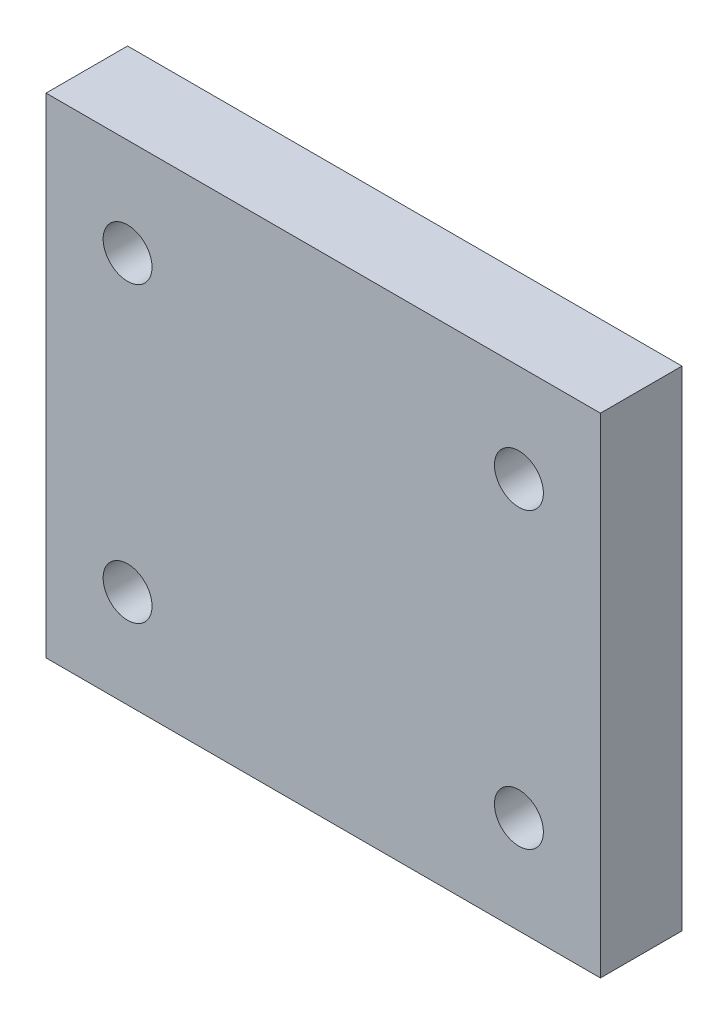
ISO-10303-21;
HEADER;
FILE_DESCRIPTION(('STEP AP214'),'2;1');
FILE_NAME('part.step','',(''),(''),'','','');
FILE_SCHEMA(('AUTOMOTIVE_DESIGN { 1 0 10303 214 1 1 1 1 }'));
ENDSEC;
DATA;
#1=APPLICATION_CONTEXT('core data for automotive mechanical design processes');
#2=APPLICATION_PROTOCOL_DEFINITION('international standard','automotive_design',2000,#1);
#3=PRODUCT_CONTEXT('',#1,'mechanical');
#4=PRODUCT('Part','Part','',(#3));
#5=PRODUCT_RELATED_PRODUCT_CATEGORY('part','',(#4));
#6=PRODUCT_DEFINITION_FORMATION('','',#4);
#7=PRODUCT_DEFINITION_CONTEXT('part definition',#1,'design');
#8=PRODUCT_DEFINITION('design','',#6,#7);
#9=PRODUCT_DEFINITION_SHAPE('','',#8);
#10=(LENGTH_UNIT() NAMED_UNIT(*) SI_UNIT(.MILLI.,.METRE.));
#11=(NAMED_UNIT(*) PLANE_ANGLE_UNIT() SI_UNIT($,.RADIAN.));
#12=(NAMED_UNIT(*) SI_UNIT($,.STERADIAN.) SOLID_ANGLE_UNIT());
#13=UNCERTAINTY_MEASURE_WITH_UNIT(LENGTH_MEASURE(1.E-05),#10,'distance_accuracy_value','');
#14=(GEOMETRIC_REPRESENTATION_CONTEXT(3) GLOBAL_UNCERTAINTY_ASSIGNED_CONTEXT((#13)) GLOBAL_UNIT_ASSIGNED_CONTEXT((#10,
#11,#12)) REPRESENTATION_CONTEXT('',''));
#15=CARTESIAN_POINT('',(0.,0.,0.));
#16=DIRECTION('',(0.,0.,1.));
#17=DIRECTION('',(1.,0.,0.));
#18=AXIS2_PLACEMENT_3D('',#15,#16,#17);
#19=CARTESIAN_POINT('',(-17.0000000000004,-14.9999999999998,5.));
#20=DIRECTION('',(1.,0.,0.));
#21=DIRECTION('',(0.,0.,-1.));
#22=AXIS2_PLACEMENT_3D('',#19,#20,#21);
#23=PLANE('',#22);
#24=DIRECTION('',(0.,-1.,0.));
#25=VECTOR('',#24,1.);
#26=CARTESIAN_POINT('',(-17.0000000000004,-14.9999999999998,0.));
#27=LINE('',#26,#25);
#28=CARTESIAN_POINT('',(-17.0000000000004,14.9999999999998,0.));
#29=VERTEX_POINT('',#28);
#30=CARTESIAN_POINT('',(-17.0000000000004,-14.9999999999998,0.));
#31=VERTEX_POINT('',#30);
#32=EDGE_CURVE('E96',#29,#31,#27,.T.);
#33=ORIENTED_EDGE('',*,*,#32,.T.);
#34=DIRECTION('',(0.,0.,-1.));
#35=VECTOR('',#34,1.);
#36=CARTESIAN_POINT('',(-17.0000000000004,-14.9999999999998,5.));
#37=LINE('',#36,#35);
#38=CARTESIAN_POINT('',(-17.0000000000004,-14.9999999999998,5.));
#39=VERTEX_POINT('',#38);
#40=EDGE_CURVE('E11',#39,#31,#37,.T.);
#41=ORIENTED_EDGE('',*,*,#40,.F.);
#42=DIRECTION('',(0.,-1.,0.));
#43=VECTOR('',#42,1.);
#44=CARTESIAN_POINT('',(-17.0000000000004,-14.9999999999998,5.));
#45=LINE('',#44,#43);
#46=CARTESIAN_POINT('',(-17.0000000000004,14.9999999999998,5.));
#47=VERTEX_POINT('',#46);
#48=EDGE_CURVE('E84',#47,#39,#45,.T.);
#49=ORIENTED_EDGE('',*,*,#48,.F.);
#50=DIRECTION('',(0.,0.,-1.));
#51=VECTOR('',#50,1.);
#52=CARTESIAN_POINT('',(-17.0000000000004,14.9999999999998,5.));
#53=LINE('',#52,#51);
#54=EDGE_CURVE('E92',#47,#29,#53,.T.);
#55=ORIENTED_EDGE('',*,*,#54,.T.);
#56=EDGE_LOOP('',(#33,#41,#49,#55));
#57=FACE_BOUND('',#56,.T.);
#58=ADVANCED_FACE('F33',(#57),#23,.F.);
#59=CARTESIAN_POINT('',(17.0000000000004,-14.9999999999998,5.));
#60=DIRECTION('',(0.,1.,0.));
#61=DIRECTION('',(0.,0.,1.));
#62=AXIS2_PLACEMENT_3D('',#59,#60,#61);
#63=PLANE('',#62);
#64=DIRECTION('',(1.,0.,0.));
#65=VECTOR('',#64,1.);
#66=CARTESIAN_POINT('',(17.0000000000004,-14.9999999999998,0.));
#67=LINE('',#66,#65);
#68=CARTESIAN_POINT('',(17.0000000000004,-14.9999999999998,0.));
#69=VERTEX_POINT('',#68);
#70=EDGE_CURVE('E88',#31,#69,#67,.T.);
#71=ORIENTED_EDGE('',*,*,#70,.T.);
#72=DIRECTION('',(0.,0.,-1.));
#73=VECTOR('',#72,1.);
#74=CARTESIAN_POINT('',(17.0000000000004,-14.9999999999998,5.));
#75=LINE('',#74,#73);
#76=CARTESIAN_POINT('',(17.0000000000004,-14.9999999999998,5.));
#77=VERTEX_POINT('',#76);
#78=EDGE_CURVE('E41',#77,#69,#75,.T.);
#79=ORIENTED_EDGE('',*,*,#78,.F.);
#80=DIRECTION('',(1.,0.,0.));
#81=VECTOR('',#80,1.);
#82=CARTESIAN_POINT('',(17.0000000000004,-14.9999999999998,5.));
#83=LINE('',#82,#81);
#84=EDGE_CURVE('E79',#39,#77,#83,.T.);
#85=ORIENTED_EDGE('',*,*,#84,.F.);
#86=ORIENTED_EDGE('',*,*,#40,.T.);
#87=EDGE_LOOP('',(#71,#79,#85,#86));
#88=FACE_BOUND('',#87,.T.);
#89=ADVANCED_FACE('F87',(#88),#63,.F.);
#90=CARTESIAN_POINT('',(17.0000000000004,-14.9999999999998,5.));
#91=DIRECTION('',(-1.,0.,0.));
#92=DIRECTION('',(0.,0.,1.));
#93=AXIS2_PLACEMENT_3D('',#90,#91,#92);
#94=PLANE('',#93);
#95=DIRECTION('',(0.,1.,0.));
#96=VECTOR('',#95,1.);
#97=CARTESIAN_POINT('',(17.0000000000004,-14.9999999999998,0.));
#98=LINE('',#97,#96);
#99=CARTESIAN_POINT('',(17.0000000000004,14.9999999999998,0.));
#100=VERTEX_POINT('',#99);
#101=EDGE_CURVE('E66',#69,#100,#98,.T.);
#102=ORIENTED_EDGE('',*,*,#101,.T.);
#103=DIRECTION('',(0.,0.,-1.));
#104=VECTOR('',#103,1.);
#105=CARTESIAN_POINT('',(17.0000000000004,14.9999999999998,5.));
#106=LINE('',#105,#104);
#107=CARTESIAN_POINT('',(17.0000000000004,14.9999999999998,5.));
#108=VERTEX_POINT('',#107);
#109=EDGE_CURVE('E89',#108,#100,#106,.T.);
#110=ORIENTED_EDGE('',*,*,#109,.F.);
#111=DIRECTION('',(0.,1.,0.));
#112=VECTOR('',#111,1.);
#113=CARTESIAN_POINT('',(17.0000000000004,-14.9999999999998,5.));
#114=LINE('',#113,#112);
#115=EDGE_CURVE('E82',#77,#108,#114,.T.);
#116=ORIENTED_EDGE('',*,*,#115,.F.);
#117=ORIENTED_EDGE('',*,*,#78,.T.);
#118=EDGE_LOOP('',(#102,#110,#116,#117));
#119=FACE_BOUND('',#118,.T.);
#120=ADVANCED_FACE('F90',(#119),#94,.F.);
#121=CARTESIAN_POINT('',(17.0000000000004,14.9999999999998,5.));
#122=DIRECTION('',(0.,-1.,0.));
#123=DIRECTION('',(0.,0.,-1.));
#124=AXIS2_PLACEMENT_3D('',#121,#122,#123);
#125=PLANE('',#124);
#126=DIRECTION('',(-1.,0.,0.));
#127=VECTOR('',#126,1.);
#128=CARTESIAN_POINT('',(17.0000000000004,14.9999999999998,0.));
#129=LINE('',#128,#127);
#130=EDGE_CURVE('E72',#100,#29,#129,.T.);
#131=ORIENTED_EDGE('',*,*,#130,.T.);
#132=ORIENTED_EDGE('',*,*,#54,.F.);
#133=DIRECTION('',(-1.,0.,0.));
#134=VECTOR('',#133,1.);
#135=CARTESIAN_POINT('',(17.0000000000004,14.9999999999998,5.));
#136=LINE('',#135,#134);
#137=EDGE_CURVE('E49',#108,#47,#136,.T.);
#138=ORIENTED_EDGE('',*,*,#137,.F.);
#139=ORIENTED_EDGE('',*,*,#109,.T.);
#140=EDGE_LOOP('',(#131,#132,#138,#139));
#141=FACE_BOUND('',#140,.T.);
#142=ADVANCED_FACE('F104',(#141),#125,.F.);
#143=CARTESIAN_POINT('',(0.,0.,5.));
#144=DIRECTION('',(0.,0.,1.));
#145=DIRECTION('',(1.,0.,0.));
#146=AXIS2_PLACEMENT_3D('',#143,#144,#145);
#147=PLANE('',#146);
#148=CARTESIAN_POINT('',(12.0000000000004,8.99999999999975,5.));
#149=DIRECTION('',(0.,0.,-1.));
#150=DIRECTION('',(-1.,0.,0.));
#151=AXIS2_PLACEMENT_3D('',#148,#149,#150);
#152=CIRCLE('',#151,1.5);
#153=CARTESIAN_POINT('',(10.5000000000004,8.99999999999975,5.));
#154=VERTEX_POINT('',#153);
#155=EDGE_CURVE('E113',#154,#154,#152,.T.);
#156=ORIENTED_EDGE('',*,*,#155,.T.);
#157=EDGE_LOOP('',(#156));
#158=FACE_BOUND('',#157,.T.);
#159=CARTESIAN_POINT('',(-11.9999999999996,-9.00000000000024,5.));
#160=DIRECTION('',(0.,0.,-1.));
#161=DIRECTION('',(-1.,0.,0.));
#162=AXIS2_PLACEMENT_3D('',#159,#160,#161);
#163=CIRCLE('',#162,1.5);
#164=CARTESIAN_POINT('',(-13.4999999999996,-9.00000000000024,5.));
#165=VERTEX_POINT('',#164);
#166=EDGE_CURVE('E119',#165,#165,#163,.T.);
#167=ORIENTED_EDGE('',*,*,#166,.T.);
#168=EDGE_LOOP('',(#167));
#169=FACE_BOUND('',#168,.T.);
#170=CARTESIAN_POINT('',(12.0000000000004,-9.00000000000024,5.));
#171=DIRECTION('',(0.,0.,-1.));
#172=DIRECTION('',(-1.,0.,0.));
#173=AXIS2_PLACEMENT_3D('',#170,#171,#172);
#174=CIRCLE('',#173,1.5);
#175=CARTESIAN_POINT('',(10.5000000000004,-9.00000000000024,5.));
#176=VERTEX_POINT('',#175);
#177=EDGE_CURVE('E120',#176,#176,#174,.T.);
#178=ORIENTED_EDGE('',*,*,#177,.T.);
#179=EDGE_LOOP('',(#178));
#180=FACE_BOUND('',#179,.T.);
#181=CARTESIAN_POINT('',(-11.9999999999996,8.99999999999976,5.));
#182=DIRECTION('',(0.,0.,-1.));
#183=DIRECTION('',(-1.,0.,0.));
#184=AXIS2_PLACEMENT_3D('',#181,#182,#183);
#185=CIRCLE('',#184,1.5);
#186=CARTESIAN_POINT('',(-13.4999999999996,8.99999999999976,5.));
#187=VERTEX_POINT('',#186);
#188=EDGE_CURVE('E99',#187,#187,#185,.T.);
#189=ORIENTED_EDGE('',*,*,#188,.T.);
#190=EDGE_LOOP('',(#189));
#191=FACE_BOUND('',#190,.T.);
#192=ORIENTED_EDGE('',*,*,#48,.T.);
#193=ORIENTED_EDGE('',*,*,#84,.T.);
#194=ORIENTED_EDGE('',*,*,#115,.T.);
#195=ORIENTED_EDGE('',*,*,#137,.T.);
#196=EDGE_LOOP('',(#192,#193,#194,#195));
#197=FACE_BOUND('',#196,.T.);
#198=ADVANCED_FACE('F80',(#158,#169,#180,#191,#197),#147,.T.);
#199=CARTESIAN_POINT('',(0.,0.,0.));
#200=DIRECTION('',(0.,0.,1.));
#201=DIRECTION('',(1.,0.,0.));
#202=AXIS2_PLACEMENT_3D('',#199,#200,#201);
#203=PLANE('',#202);
#204=CARTESIAN_POINT('',(12.0000000000004,8.99999999999975,0.));
#205=DIRECTION('',(0.,0.,-1.));
#206=DIRECTION('',(-1.,0.,0.));
#207=AXIS2_PLACEMENT_3D('',#204,#205,#206);
#208=CIRCLE('',#207,1.5);
#209=CARTESIAN_POINT('',(10.5000000000004,8.99999999999975,0.));
#210=VERTEX_POINT('',#209);
#211=EDGE_CURVE('E123',#210,#210,#208,.T.);
#212=ORIENTED_EDGE('',*,*,#211,.F.);
#213=EDGE_LOOP('',(#212));
#214=FACE_BOUND('',#213,.T.);
#215=CARTESIAN_POINT('',(-11.9999999999996,-9.00000000000024,0.));
#216=DIRECTION('',(0.,0.,-1.));
#217=DIRECTION('',(-1.,0.,0.));
#218=AXIS2_PLACEMENT_3D('',#215,#216,#217);
#219=CIRCLE('',#218,1.5);
#220=CARTESIAN_POINT('',(-13.4999999999996,-9.00000000000024,0.));
#221=VERTEX_POINT('',#220);
#222=EDGE_CURVE('E116',#221,#221,#219,.T.);
#223=ORIENTED_EDGE('',*,*,#222,.F.);
#224=EDGE_LOOP('',(#223));
#225=FACE_BOUND('',#224,.T.);
#226=CARTESIAN_POINT('',(12.0000000000004,-9.00000000000024,0.));
#227=DIRECTION('',(0.,0.,-1.));
#228=DIRECTION('',(-1.,0.,0.));
#229=AXIS2_PLACEMENT_3D('',#226,#227,#228);
#230=CIRCLE('',#229,1.5);
#231=CARTESIAN_POINT('',(10.5000000000004,-9.00000000000024,0.));
#232=VERTEX_POINT('',#231);
#233=EDGE_CURVE('E128',#232,#232,#230,.T.);
#234=ORIENTED_EDGE('',*,*,#233,.F.);
#235=EDGE_LOOP('',(#234));
#236=FACE_BOUND('',#235,.T.);
#237=CARTESIAN_POINT('',(-11.9999999999996,8.99999999999976,0.));
#238=DIRECTION('',(0.,0.,-1.));
#239=DIRECTION('',(-1.,0.,0.));
#240=AXIS2_PLACEMENT_3D('',#237,#238,#239);
#241=CIRCLE('',#240,1.5);
#242=CARTESIAN_POINT('',(-13.4999999999996,8.99999999999976,0.));
#243=VERTEX_POINT('',#242);
#244=EDGE_CURVE('E110',#243,#243,#241,.T.);
#245=ORIENTED_EDGE('',*,*,#244,.F.);
#246=EDGE_LOOP('',(#245));
#247=FACE_BOUND('',#246,.T.);
#248=ORIENTED_EDGE('',*,*,#32,.F.);
#249=ORIENTED_EDGE('',*,*,#130,.F.);
#250=ORIENTED_EDGE('',*,*,#101,.F.);
#251=ORIENTED_EDGE('',*,*,#70,.F.);
#252=EDGE_LOOP('',(#248,#249,#250,#251));
#253=FACE_BOUND('',#252,.T.);
#254=ADVANCED_FACE('F107',(#214,#225,#236,#247,#253),#203,.F.);
#255=CARTESIAN_POINT('',(-11.9999999999996,8.99999999999976,5.));
#256=DIRECTION('',(0.,0.,-1.));
#257=DIRECTION('',(-1.,0.,0.));
#258=AXIS2_PLACEMENT_3D('',#255,#256,#257);
#259=CYLINDRICAL_SURFACE('',#258,1.5);
#260=ORIENTED_EDGE('',*,*,#188,.F.);
#261=EDGE_LOOP('',(#260));
#262=FACE_BOUND('',#261,.T.);
#263=ORIENTED_EDGE('',*,*,#244,.T.);
#264=EDGE_LOOP('',(#263));
#265=FACE_BOUND('',#264,.T.);
#266=ADVANCED_FACE('F140',(#262,#265),#259,.F.);
#267=CARTESIAN_POINT('',(12.0000000000004,-9.00000000000024,5.));
#268=DIRECTION('',(0.,0.,-1.));
#269=DIRECTION('',(-1.,0.,0.));
#270=AXIS2_PLACEMENT_3D('',#267,#268,#269);
#271=CYLINDRICAL_SURFACE('',#270,1.5);
#272=ORIENTED_EDGE('',*,*,#177,.F.);
#273=EDGE_LOOP('',(#272));
#274=FACE_BOUND('',#273,.T.);
#275=ORIENTED_EDGE('',*,*,#233,.T.);
#276=EDGE_LOOP('',(#275));
#277=FACE_BOUND('',#276,.T.);
#278=ADVANCED_FACE('F136',(#274,#277),#271,.F.);
#279=CARTESIAN_POINT('',(-11.9999999999996,-9.00000000000024,5.));
#280=DIRECTION('',(0.,0.,-1.));
#281=DIRECTION('',(-1.,0.,0.));
#282=AXIS2_PLACEMENT_3D('',#279,#280,#281);
#283=CYLINDRICAL_SURFACE('',#282,1.5);
#284=ORIENTED_EDGE('',*,*,#166,.F.);
#285=EDGE_LOOP('',(#284));
#286=FACE_BOUND('',#285,.T.);
#287=ORIENTED_EDGE('',*,*,#222,.T.);
#288=EDGE_LOOP('',(#287));
#289=FACE_BOUND('',#288,.T.);
#290=ADVANCED_FACE('F139',(#286,#289),#283,.F.);
#291=CARTESIAN_POINT('',(12.0000000000004,8.99999999999975,5.));
#292=DIRECTION('',(0.,0.,-1.));
#293=DIRECTION('',(-1.,0.,0.));
#294=AXIS2_PLACEMENT_3D('',#291,#292,#293);
#295=CYLINDRICAL_SURFACE('',#294,1.5);
#296=ORIENTED_EDGE('',*,*,#155,.F.);
#297=EDGE_LOOP('',(#296));
#298=FACE_BOUND('',#297,.T.);
#299=ORIENTED_EDGE('',*,*,#211,.T.);
#300=EDGE_LOOP('',(#299));
#301=FACE_BOUND('',#300,.T.);
#302=ADVANCED_FACE('F180',(#298,#301),#295,.F.);
#303=CLOSED_SHELL('',(#58,#89,#120,#142,#198,#254,#266,#278,#290,#302));
#304=MANIFOLD_SOLID_BREP('B2',#303);
#305=ADVANCED_BREP_SHAPE_REPRESENTATION('',(#18,#304),#14);
#306=SHAPE_DEFINITION_REPRESENTATION(#9,#305);
ENDSEC;
END-ISO-10303-21;
